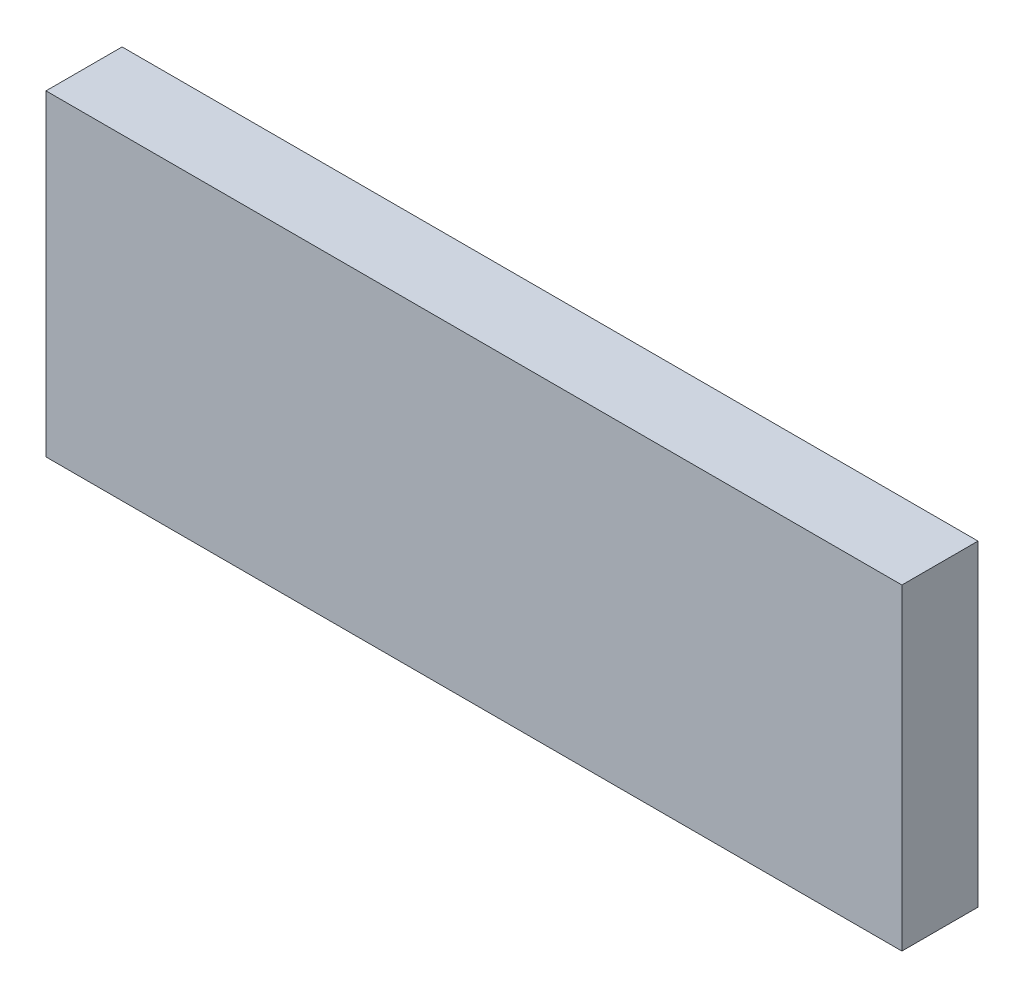
ISO-10303-21;
HEADER;
FILE_DESCRIPTION(('STEP AP214'),'2;1');
FILE_NAME('part.step','',(''),(''),'','','');
FILE_SCHEMA(('AUTOMOTIVE_DESIGN { 1 0 10303 214 1 1 1 1 }'));
ENDSEC;
DATA;
#1=APPLICATION_CONTEXT('core data for automotive mechanical design processes');
#2=APPLICATION_PROTOCOL_DEFINITION('international standard','automotive_design',2000,#1);
#3=PRODUCT_CONTEXT('',#1,'mechanical');
#4=PRODUCT('Part','Part','',(#3));
#5=PRODUCT_RELATED_PRODUCT_CATEGORY('part','',(#4));
#6=PRODUCT_DEFINITION_FORMATION('','',#4);
#7=PRODUCT_DEFINITION_CONTEXT('part definition',#1,'design');
#8=PRODUCT_DEFINITION('design','',#6,#7);
#9=PRODUCT_DEFINITION_SHAPE('','',#8);
#10=(LENGTH_UNIT() NAMED_UNIT(*) SI_UNIT(.MILLI.,.METRE.));
#11=(NAMED_UNIT(*) PLANE_ANGLE_UNIT() SI_UNIT($,.RADIAN.));
#12=(NAMED_UNIT(*) SI_UNIT($,.STERADIAN.) SOLID_ANGLE_UNIT());
#13=UNCERTAINTY_MEASURE_WITH_UNIT(LENGTH_MEASURE(1.E-05),#10,'distance_accuracy_value','');
#14=(GEOMETRIC_REPRESENTATION_CONTEXT(3) GLOBAL_UNCERTAINTY_ASSIGNED_CONTEXT((#13)) GLOBAL_UNIT_ASSIGNED_CONTEXT((#10,
#11,#12)) REPRESENTATION_CONTEXT('',''));
#15=CARTESIAN_POINT('',(0.,0.,0.));
#16=DIRECTION('',(0.,0.,1.));
#17=DIRECTION('',(1.,0.,0.));
#18=AXIS2_PLACEMENT_3D('',#15,#16,#17);
#19=CARTESIAN_POINT('',(1.68721024,-0.62500002,0.30000194));
#20=DIRECTION('',(0.,0.,1.));
#21=DIRECTION('',(1.,0.,0.));
#22=AXIS2_PLACEMENT_3D('',#19,#20,#21);
#23=PLANE('',#22);
#24=DIRECTION('',(0.,-1.,0.));
#25=VECTOR('',#24,1.);
#26=CARTESIAN_POINT('',(1.68721024,0.62500002,0.30000194));
#27=LINE('',#26,#25);
#28=CARTESIAN_POINT('',(1.68721024,0.62500002,0.30000194));
#29=VERTEX_POINT('',#28);
#30=CARTESIAN_POINT('',(1.68721024,-0.62500002,0.30000194));
#31=VERTEX_POINT('',#30);
#32=EDGE_CURVE('E21',#29,#31,#27,.T.);
#33=ORIENTED_EDGE('',*,*,#32,.F.);
#34=DIRECTION('',(1.,0.,0.));
#35=VECTOR('',#34,1.);
#36=CARTESIAN_POINT('',(-1.68721024,0.62500002,0.30000194));
#37=LINE('',#36,#35);
#38=CARTESIAN_POINT('',(-1.68721024,0.62500002,0.30000194));
#39=VERTEX_POINT('',#38);
#40=EDGE_CURVE('E57',#39,#29,#37,.T.);
#41=ORIENTED_EDGE('',*,*,#40,.F.);
#42=DIRECTION('',(0.,1.,0.));
#43=VECTOR('',#42,1.);
#44=CARTESIAN_POINT('',(-1.68721024,-0.62500002,0.30000194));
#45=LINE('',#44,#43);
#46=CARTESIAN_POINT('',(-1.68721024,-0.62500002,0.30000194));
#47=VERTEX_POINT('',#46);
#48=EDGE_CURVE('E85',#47,#39,#45,.T.);
#49=ORIENTED_EDGE('',*,*,#48,.F.);
#50=DIRECTION('',(-1.,0.,0.));
#51=VECTOR('',#50,1.);
#52=CARTESIAN_POINT('',(1.68721024,-0.62500002,0.30000194));
#53=LINE('',#52,#51);
#54=EDGE_CURVE('E89',#31,#47,#53,.T.);
#55=ORIENTED_EDGE('',*,*,#54,.F.);
#56=EDGE_LOOP('',(#33,#41,#49,#55));
#57=FACE_BOUND('',#56,.T.);
#58=ADVANCED_FACE('F17',(#57),#23,.T.);
#59=CARTESIAN_POINT('',(1.68721024,-0.62500002,0.));
#60=DIRECTION('',(0.,0.,1.));
#61=DIRECTION('',(1.,0.,0.));
#62=AXIS2_PLACEMENT_3D('',#59,#60,#61);
#63=PLANE('',#62);
#64=DIRECTION('',(-1.,0.,0.));
#65=VECTOR('',#64,1.);
#66=CARTESIAN_POINT('',(1.68721024,-0.62500002,0.));
#67=LINE('',#66,#65);
#68=CARTESIAN_POINT('',(1.68721024,-0.62500002,0.));
#69=VERTEX_POINT('',#68);
#70=CARTESIAN_POINT('',(-1.68721024,-0.62500002,0.));
#71=VERTEX_POINT('',#70);
#72=EDGE_CURVE('E79',#69,#71,#67,.T.);
#73=ORIENTED_EDGE('',*,*,#72,.T.);
#74=DIRECTION('',(0.,1.,0.));
#75=VECTOR('',#74,1.);
#76=CARTESIAN_POINT('',(-1.68721024,-0.62500002,0.));
#77=LINE('',#76,#75);
#78=CARTESIAN_POINT('',(-1.68721024,0.62500002,0.));
#79=VERTEX_POINT('',#78);
#80=EDGE_CURVE('E68',#71,#79,#77,.T.);
#81=ORIENTED_EDGE('',*,*,#80,.T.);
#82=DIRECTION('',(1.,0.,0.));
#83=VECTOR('',#82,1.);
#84=CARTESIAN_POINT('',(-1.68721024,0.62500002,0.));
#85=LINE('',#84,#83);
#86=CARTESIAN_POINT('',(1.68721024,0.62500002,0.));
#87=VERTEX_POINT('',#86);
#88=EDGE_CURVE('E103',#79,#87,#85,.T.);
#89=ORIENTED_EDGE('',*,*,#88,.T.);
#90=DIRECTION('',(0.,-1.,0.));
#91=VECTOR('',#90,1.);
#92=CARTESIAN_POINT('',(1.68721024,0.62500002,0.));
#93=LINE('',#92,#91);
#94=EDGE_CURVE('E11',#87,#69,#93,.T.);
#95=ORIENTED_EDGE('',*,*,#94,.T.);
#96=EDGE_LOOP('',(#73,#81,#89,#95));
#97=FACE_BOUND('',#96,.T.);
#98=ADVANCED_FACE('F80',(#97),#63,.F.);
#99=CARTESIAN_POINT('',(1.68721024,0.62500002,0.));
#100=DIRECTION('',(1.,0.,0.));
#101=DIRECTION('',(0.,1.,0.));
#102=AXIS2_PLACEMENT_3D('',#99,#100,#101);
#103=PLANE('',#102);
#104=DIRECTION('',(0.,0.,1.));
#105=VECTOR('',#104,1.);
#106=CARTESIAN_POINT('',(1.68721024,0.62500002,0.));
#107=LINE('',#106,#105);
#108=EDGE_CURVE('E101',#87,#29,#107,.T.);
#109=ORIENTED_EDGE('',*,*,#108,.T.);
#110=ORIENTED_EDGE('',*,*,#32,.T.);
#111=DIRECTION('',(0.,0.,1.));
#112=VECTOR('',#111,1.);
#113=CARTESIAN_POINT('',(1.68721024,-0.62500002,0.));
#114=LINE('',#113,#112);
#115=EDGE_CURVE('E96',#69,#31,#114,.T.);
#116=ORIENTED_EDGE('',*,*,#115,.F.);
#117=ORIENTED_EDGE('',*,*,#94,.F.);
#118=EDGE_LOOP('',(#109,#110,#116,#117));
#119=FACE_BOUND('',#118,.T.);
#120=ADVANCED_FACE('F114',(#119),#103,.T.);
#121=CARTESIAN_POINT('',(-1.68721024,0.62500002,0.));
#122=DIRECTION('',(0.,1.,0.));
#123=DIRECTION('',(1.,0.,0.));
#124=AXIS2_PLACEMENT_3D('',#121,#122,#123);
#125=PLANE('',#124);
#126=DIRECTION('',(0.,0.,1.));
#127=VECTOR('',#126,1.);
#128=CARTESIAN_POINT('',(-1.68721024,0.62500002,0.));
#129=LINE('',#128,#127);
#130=EDGE_CURVE('E74',#79,#39,#129,.T.);
#131=ORIENTED_EDGE('',*,*,#130,.T.);
#132=ORIENTED_EDGE('',*,*,#40,.T.);
#133=ORIENTED_EDGE('',*,*,#108,.F.);
#134=ORIENTED_EDGE('',*,*,#88,.F.);
#135=EDGE_LOOP('',(#131,#132,#133,#134));
#136=FACE_BOUND('',#135,.T.);
#137=ADVANCED_FACE('F127',(#136),#125,.T.);
#138=CARTESIAN_POINT('',(-1.68721024,-0.62500002,0.));
#139=DIRECTION('',(-1.,0.,0.));
#140=DIRECTION('',(0.,0.,1.));
#141=AXIS2_PLACEMENT_3D('',#138,#139,#140);
#142=PLANE('',#141);
#143=DIRECTION('',(0.,0.,1.));
#144=VECTOR('',#143,1.);
#145=CARTESIAN_POINT('',(-1.68721024,-0.62500002,0.));
#146=LINE('',#145,#144);
#147=EDGE_CURVE('E72',#71,#47,#146,.T.);
#148=ORIENTED_EDGE('',*,*,#147,.T.);
#149=ORIENTED_EDGE('',*,*,#48,.T.);
#150=ORIENTED_EDGE('',*,*,#130,.F.);
#151=ORIENTED_EDGE('',*,*,#80,.F.);
#152=EDGE_LOOP('',(#148,#149,#150,#151));
#153=FACE_BOUND('',#152,.T.);
#154=ADVANCED_FACE('F19',(#153),#142,.T.);
#155=CARTESIAN_POINT('',(1.68721024,-0.62500002,0.));
#156=DIRECTION('',(0.,-1.,0.));
#157=DIRECTION('',(0.,0.,-1.));
#158=AXIS2_PLACEMENT_3D('',#155,#156,#157);
#159=PLANE('',#158);
#160=ORIENTED_EDGE('',*,*,#115,.T.);
#161=ORIENTED_EDGE('',*,*,#54,.T.);
#162=ORIENTED_EDGE('',*,*,#147,.F.);
#163=ORIENTED_EDGE('',*,*,#72,.F.);
#164=EDGE_LOOP('',(#160,#161,#162,#163));
#165=FACE_BOUND('',#164,.T.);
#166=ADVANCED_FACE('F87',(#165),#159,.T.);
#167=CLOSED_SHELL('',(#58,#98,#120,#137,#154,#166));
#168=MANIFOLD_SOLID_BREP('B1',#167);
#169=ADVANCED_BREP_SHAPE_REPRESENTATION('',(#18,#168),#14);
#170=SHAPE_DEFINITION_REPRESENTATION(#9,#169);
ENDSEC;
END-ISO-10303-21;
